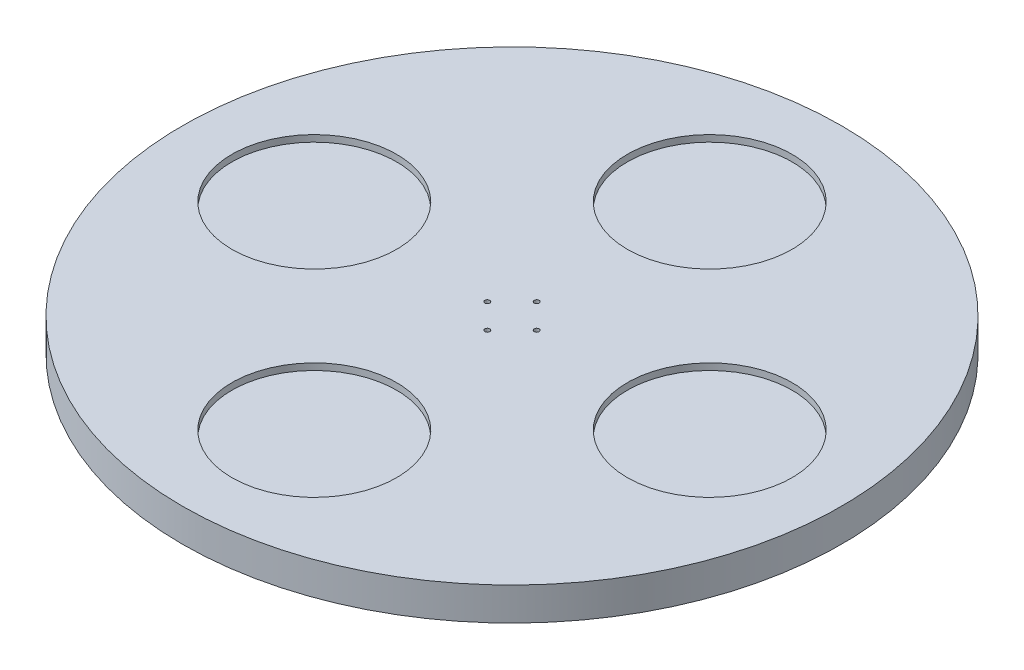
ISO-10303-21;
HEADER;
FILE_DESCRIPTION(('STEP AP214'),'2;1');
FILE_NAME('part.step','',(''),(''),'','','');
FILE_SCHEMA(('AUTOMOTIVE_DESIGN { 1 0 10303 214 1 1 1 1 }'));
ENDSEC;
DATA;
#1=APPLICATION_CONTEXT('core data for automotive mechanical design processes');
#2=APPLICATION_PROTOCOL_DEFINITION('international standard','automotive_design',2000,#1);
#3=PRODUCT_CONTEXT('',#1,'mechanical');
#4=PRODUCT('Part','Part','',(#3));
#5=PRODUCT_RELATED_PRODUCT_CATEGORY('part','',(#4));
#6=PRODUCT_DEFINITION_FORMATION('','',#4);
#7=PRODUCT_DEFINITION_CONTEXT('part definition',#1,'design');
#8=PRODUCT_DEFINITION('design','',#6,#7);
#9=PRODUCT_DEFINITION_SHAPE('','',#8);
#10=(LENGTH_UNIT() NAMED_UNIT(*) SI_UNIT(.MILLI.,.METRE.));
#11=(NAMED_UNIT(*) PLANE_ANGLE_UNIT() SI_UNIT($,.RADIAN.));
#12=(NAMED_UNIT(*) SI_UNIT($,.STERADIAN.) SOLID_ANGLE_UNIT());
#13=UNCERTAINTY_MEASURE_WITH_UNIT(LENGTH_MEASURE(1.E-05),#10,'distance_accuracy_value','');
#14=(GEOMETRIC_REPRESENTATION_CONTEXT(3) GLOBAL_UNCERTAINTY_ASSIGNED_CONTEXT((#13)) GLOBAL_UNIT_ASSIGNED_CONTEXT((#10,
#11,#12)) REPRESENTATION_CONTEXT('',''));
#15=CARTESIAN_POINT('',(0.,0.,0.));
#16=DIRECTION('',(0.,0.,1.));
#17=DIRECTION('',(1.,0.,0.));
#18=AXIS2_PLACEMENT_3D('',#15,#16,#17);
#19=CARTESIAN_POINT('',(0.,10.,0.));
#20=DIRECTION('',(0.,-1.,0.));
#21=DIRECTION('',(0.,0.,-1.));
#22=AXIS2_PLACEMENT_3D('',#19,#20,#21);
#23=CYLINDRICAL_SURFACE('',#22,100.);
#24=CARTESIAN_POINT('',(0.,10.,0.));
#25=DIRECTION('',(0.,1.,0.));
#26=DIRECTION('',(0.,0.,1.));
#27=AXIS2_PLACEMENT_3D('',#24,#25,#26);
#28=CIRCLE('',#27,100.);
#29=CARTESIAN_POINT('',(0.,10.,100.));
#30=VERTEX_POINT('',#29);
#31=EDGE_CURVE('E10',#30,#30,#28,.T.);
#32=ORIENTED_EDGE('',*,*,#31,.F.);
#33=EDGE_LOOP('',(#32));
#34=FACE_BOUND('',#33,.T.);
#35=CARTESIAN_POINT('',(0.,0.,0.));
#36=DIRECTION('',(0.,1.,0.));
#37=DIRECTION('',(0.,0.,1.));
#38=AXIS2_PLACEMENT_3D('',#35,#36,#37);
#39=CIRCLE('',#38,100.);
#40=CARTESIAN_POINT('',(0.,0.,100.));
#41=VERTEX_POINT('',#40);
#42=EDGE_CURVE('E33',#41,#41,#39,.T.);
#43=ORIENTED_EDGE('',*,*,#42,.T.);
#44=EDGE_LOOP('',(#43));
#45=FACE_BOUND('',#44,.T.);
#46=ADVANCED_FACE('F30',(#34,#45),#23,.T.);
#47=CARTESIAN_POINT('',(0.,10.,0.));
#48=DIRECTION('',(0.,1.,0.));
#49=DIRECTION('',(0.,0.,1.));
#50=AXIS2_PLACEMENT_3D('',#47,#48,#49);
#51=PLANE('',#50);
#52=CARTESIAN_POINT('',(-60.,10.,0.));
#53=DIRECTION('',(0.,1.,0.));
#54=DIRECTION('',(0.,0.,1.));
#55=AXIS2_PLACEMENT_3D('',#52,#53,#54);
#56=CIRCLE('',#55,25.);
#57=CARTESIAN_POINT('',(-60.,10.,25.));
#58=VERTEX_POINT('',#57);
#59=EDGE_CURVE('E84',#58,#58,#56,.T.);
#60=ORIENTED_EDGE('',*,*,#59,.F.);
#61=EDGE_LOOP('',(#60));
#62=FACE_BOUND('',#61,.T.);
#63=CARTESIAN_POINT('',(0.,10.,-60.));
#64=DIRECTION('',(0.,1.,0.));
#65=DIRECTION('',(0.,0.,1.));
#66=AXIS2_PLACEMENT_3D('',#63,#64,#65);
#67=CIRCLE('',#66,25.);
#68=CARTESIAN_POINT('',(0.,10.,-35.));
#69=VERTEX_POINT('',#68);
#70=EDGE_CURVE('E78',#69,#69,#67,.T.);
#71=ORIENTED_EDGE('',*,*,#70,.F.);
#72=EDGE_LOOP('',(#71));
#73=FACE_BOUND('',#72,.T.);
#74=CARTESIAN_POINT('',(60.,10.,0.));
#75=DIRECTION('',(0.,1.,0.));
#76=DIRECTION('',(0.,0.,1.));
#77=AXIS2_PLACEMENT_3D('',#74,#75,#76);
#78=CIRCLE('',#77,25.);
#79=CARTESIAN_POINT('',(60.,10.,25.));
#80=VERTEX_POINT('',#79);
#81=EDGE_CURVE('E72',#80,#80,#78,.T.);
#82=ORIENTED_EDGE('',*,*,#81,.F.);
#83=EDGE_LOOP('',(#82));
#84=FACE_BOUND('',#83,.T.);
#85=CARTESIAN_POINT('',(0.,10.,60.));
#86=DIRECTION('',(0.,1.,0.));
#87=DIRECTION('',(0.,0.,1.));
#88=AXIS2_PLACEMENT_3D('',#85,#86,#87);
#89=CIRCLE('',#88,25.);
#90=CARTESIAN_POINT('',(0.,10.,85.));
#91=VERTEX_POINT('',#90);
#92=EDGE_CURVE('E66',#91,#91,#89,.T.);
#93=ORIENTED_EDGE('',*,*,#92,.F.);
#94=EDGE_LOOP('',(#93));
#95=FACE_BOUND('',#94,.T.);
#96=CARTESIAN_POINT('',(-7.5,10.,0.));
#97=DIRECTION('',(0.,1.,0.));
#98=DIRECTION('',(0.,0.,1.));
#99=AXIS2_PLACEMENT_3D('',#96,#97,#98);
#100=CIRCLE('',#99,0.75);
#101=CARTESIAN_POINT('',(-7.5,10.,0.75));
#102=VERTEX_POINT('',#101);
#103=EDGE_CURVE('E61',#102,#102,#100,.T.);
#104=ORIENTED_EDGE('',*,*,#103,.F.);
#105=EDGE_LOOP('',(#104));
#106=FACE_BOUND('',#105,.T.);
#107=CARTESIAN_POINT('',(0.,10.,7.5));
#108=DIRECTION('',(0.,1.,0.));
#109=DIRECTION('',(0.,0.,1.));
#110=AXIS2_PLACEMENT_3D('',#107,#108,#109);
#111=CIRCLE('',#110,0.750000000000001);
#112=CARTESIAN_POINT('',(0.,10.,8.25));
#113=VERTEX_POINT('',#112);
#114=EDGE_CURVE('E58',#113,#113,#111,.T.);
#115=ORIENTED_EDGE('',*,*,#114,.F.);
#116=EDGE_LOOP('',(#115));
#117=FACE_BOUND('',#116,.T.);
#118=CARTESIAN_POINT('',(7.5,10.,0.));
#119=DIRECTION('',(0.,1.,0.));
#120=DIRECTION('',(0.,0.,1.));
#121=AXIS2_PLACEMENT_3D('',#118,#119,#120);
#122=CIRCLE('',#121,0.750000000000001);
#123=CARTESIAN_POINT('',(7.5,10.,0.750000000000053));
#124=VERTEX_POINT('',#123);
#125=EDGE_CURVE('E52',#124,#124,#122,.T.);
#126=ORIENTED_EDGE('',*,*,#125,.F.);
#127=EDGE_LOOP('',(#126));
#128=FACE_BOUND('',#127,.T.);
#129=CARTESIAN_POINT('',(0.,10.,-7.5));
#130=DIRECTION('',(0.,1.,0.));
#131=DIRECTION('',(0.,0.,1.));
#132=AXIS2_PLACEMENT_3D('',#129,#130,#131);
#133=CIRCLE('',#132,0.75);
#134=CARTESIAN_POINT('',(0.,10.,-6.75));
#135=VERTEX_POINT('',#134);
#136=EDGE_CURVE('E45',#135,#135,#133,.T.);
#137=ORIENTED_EDGE('',*,*,#136,.F.);
#138=EDGE_LOOP('',(#137));
#139=FACE_BOUND('',#138,.T.);
#140=ORIENTED_EDGE('',*,*,#31,.T.);
#141=EDGE_LOOP('',(#140));
#142=FACE_BOUND('',#141,.T.);
#143=ADVANCED_FACE('F99',(#62,#73,#84,#95,#106,#117,#128,#139,#142),#51,.T.);
#144=CARTESIAN_POINT('',(0.,0.,0.));
#145=DIRECTION('',(0.,1.,0.));
#146=DIRECTION('',(0.,0.,1.));
#147=AXIS2_PLACEMENT_3D('',#144,#145,#146);
#148=PLANE('',#147);
#149=CARTESIAN_POINT('',(-7.5,0.,0.));
#150=DIRECTION('',(0.,1.,0.));
#151=DIRECTION('',(0.,0.,1.));
#152=AXIS2_PLACEMENT_3D('',#149,#150,#151);
#153=CIRCLE('',#152,0.75);
#154=CARTESIAN_POINT('',(-7.5,0.,0.75));
#155=VERTEX_POINT('',#154);
#156=EDGE_CURVE('E40',#155,#155,#153,.T.);
#157=ORIENTED_EDGE('',*,*,#156,.T.);
#158=EDGE_LOOP('',(#157));
#159=FACE_BOUND('',#158,.T.);
#160=CARTESIAN_POINT('',(0.,0.,7.5));
#161=DIRECTION('',(0.,1.,0.));
#162=DIRECTION('',(0.,0.,1.));
#163=AXIS2_PLACEMENT_3D('',#160,#161,#162);
#164=CIRCLE('',#163,0.750000000000001);
#165=CARTESIAN_POINT('',(0.,0.,8.25));
#166=VERTEX_POINT('',#165);
#167=EDGE_CURVE('E55',#166,#166,#164,.T.);
#168=ORIENTED_EDGE('',*,*,#167,.T.);
#169=EDGE_LOOP('',(#168));
#170=FACE_BOUND('',#169,.T.);
#171=CARTESIAN_POINT('',(7.5,0.,0.));
#172=DIRECTION('',(0.,1.,0.));
#173=DIRECTION('',(0.,0.,1.));
#174=AXIS2_PLACEMENT_3D('',#171,#172,#173);
#175=CIRCLE('',#174,0.750000000000001);
#176=CARTESIAN_POINT('',(7.5,0.,0.750000000000053));
#177=VERTEX_POINT('',#176);
#178=EDGE_CURVE('E49',#177,#177,#175,.T.);
#179=ORIENTED_EDGE('',*,*,#178,.T.);
#180=EDGE_LOOP('',(#179));
#181=FACE_BOUND('',#180,.T.);
#182=CARTESIAN_POINT('',(0.,0.,-7.5));
#183=DIRECTION('',(0.,1.,0.));
#184=DIRECTION('',(0.,0.,1.));
#185=AXIS2_PLACEMENT_3D('',#182,#183,#184);
#186=CIRCLE('',#185,0.75);
#187=CARTESIAN_POINT('',(0.,0.,-6.75));
#188=VERTEX_POINT('',#187);
#189=EDGE_CURVE('E42',#188,#188,#186,.T.);
#190=ORIENTED_EDGE('',*,*,#189,.T.);
#191=EDGE_LOOP('',(#190));
#192=FACE_BOUND('',#191,.T.);
#193=ORIENTED_EDGE('',*,*,#42,.F.);
#194=EDGE_LOOP('',(#193));
#195=FACE_BOUND('',#194,.T.);
#196=ADVANCED_FACE('F102',(#159,#170,#181,#192,#195),#148,.F.);
#197=CARTESIAN_POINT('',(0.,0.,-7.5));
#198=DIRECTION('',(0.,1.,0.));
#199=DIRECTION('',(0.,0.,1.));
#200=AXIS2_PLACEMENT_3D('',#197,#198,#199);
#201=CYLINDRICAL_SURFACE('',#200,0.75);
#202=ORIENTED_EDGE('',*,*,#189,.F.);
#203=EDGE_LOOP('',(#202));
#204=FACE_BOUND('',#203,.T.);
#205=ORIENTED_EDGE('',*,*,#136,.T.);
#206=EDGE_LOOP('',(#205));
#207=FACE_BOUND('',#206,.T.);
#208=ADVANCED_FACE('F118',(#204,#207),#201,.F.);
#209=CARTESIAN_POINT('',(7.5,0.,0.));
#210=DIRECTION('',(0.,1.,0.));
#211=DIRECTION('',(0.,0.,1.));
#212=AXIS2_PLACEMENT_3D('',#209,#210,#211);
#213=CYLINDRICAL_SURFACE('',#212,0.750000000000001);
#214=ORIENTED_EDGE('',*,*,#178,.F.);
#215=EDGE_LOOP('',(#214));
#216=FACE_BOUND('',#215,.T.);
#217=ORIENTED_EDGE('',*,*,#125,.T.);
#218=EDGE_LOOP('',(#217));
#219=FACE_BOUND('',#218,.T.);
#220=ADVANCED_FACE('F120',(#216,#219),#213,.F.);
#221=CARTESIAN_POINT('',(0.,0.,7.5));
#222=DIRECTION('',(0.,1.,0.));
#223=DIRECTION('',(0.,0.,1.));
#224=AXIS2_PLACEMENT_3D('',#221,#222,#223);
#225=CYLINDRICAL_SURFACE('',#224,0.750000000000001);
#226=ORIENTED_EDGE('',*,*,#167,.F.);
#227=EDGE_LOOP('',(#226));
#228=FACE_BOUND('',#227,.T.);
#229=ORIENTED_EDGE('',*,*,#114,.T.);
#230=EDGE_LOOP('',(#229));
#231=FACE_BOUND('',#230,.T.);
#232=ADVANCED_FACE('F127',(#228,#231),#225,.F.);
#233=CARTESIAN_POINT('',(-7.5,0.,0.));
#234=DIRECTION('',(0.,1.,0.));
#235=DIRECTION('',(0.,0.,1.));
#236=AXIS2_PLACEMENT_3D('',#233,#234,#235);
#237=CYLINDRICAL_SURFACE('',#236,0.75);
#238=ORIENTED_EDGE('',*,*,#156,.F.);
#239=EDGE_LOOP('',(#238));
#240=FACE_BOUND('',#239,.T.);
#241=ORIENTED_EDGE('',*,*,#103,.T.);
#242=EDGE_LOOP('',(#241));
#243=FACE_BOUND('',#242,.T.);
#244=ADVANCED_FACE('F167',(#240,#243),#237,.F.);
#245=CARTESIAN_POINT('',(0.,8.,60.));
#246=DIRECTION('',(0.,1.,0.));
#247=DIRECTION('',(0.,0.,1.));
#248=AXIS2_PLACEMENT_3D('',#245,#246,#247);
#249=CYLINDRICAL_SURFACE('',#248,25.);
#250=CARTESIAN_POINT('',(0.,8.,60.));
#251=DIRECTION('',(0.,1.,0.));
#252=DIRECTION('',(0.,0.,1.));
#253=AXIS2_PLACEMENT_3D('',#250,#251,#252);
#254=CIRCLE('',#253,25.);
#255=CARTESIAN_POINT('',(0.,8.,85.));
#256=VERTEX_POINT('',#255);
#257=EDGE_CURVE('E69',#256,#256,#254,.T.);
#258=ORIENTED_EDGE('',*,*,#257,.F.);
#259=EDGE_LOOP('',(#258));
#260=FACE_BOUND('',#259,.T.);
#261=ORIENTED_EDGE('',*,*,#92,.T.);
#262=EDGE_LOOP('',(#261));
#263=FACE_BOUND('',#262,.T.);
#264=ADVANCED_FACE('F176',(#260,#263),#249,.F.);
#265=CARTESIAN_POINT('',(0.,8.,60.));
#266=DIRECTION('',(0.,1.,0.));
#267=DIRECTION('',(0.,0.,1.));
#268=AXIS2_PLACEMENT_3D('',#265,#266,#267);
#269=PLANE('',#268);
#270=ORIENTED_EDGE('',*,*,#257,.T.);
#271=EDGE_LOOP('',(#270));
#272=FACE_BOUND('',#271,.T.);
#273=ADVANCED_FACE('F186',(#272),#269,.T.);
#274=CARTESIAN_POINT('',(60.,8.,0.));
#275=DIRECTION('',(0.,1.,0.));
#276=DIRECTION('',(0.,0.,1.));
#277=AXIS2_PLACEMENT_3D('',#274,#275,#276);
#278=CYLINDRICAL_SURFACE('',#277,25.);
#279=CARTESIAN_POINT('',(60.,8.,0.));
#280=DIRECTION('',(0.,1.,0.));
#281=DIRECTION('',(0.,0.,1.));
#282=AXIS2_PLACEMENT_3D('',#279,#280,#281);
#283=CIRCLE('',#282,25.);
#284=CARTESIAN_POINT('',(60.,8.,25.));
#285=VERTEX_POINT('',#284);
#286=EDGE_CURVE('E75',#285,#285,#283,.T.);
#287=ORIENTED_EDGE('',*,*,#286,.F.);
#288=EDGE_LOOP('',(#287));
#289=FACE_BOUND('',#288,.T.);
#290=ORIENTED_EDGE('',*,*,#81,.T.);
#291=EDGE_LOOP('',(#290));
#292=FACE_BOUND('',#291,.T.);
#293=ADVANCED_FACE('F193',(#289,#292),#278,.F.);
#294=CARTESIAN_POINT('',(60.,8.,0.));
#295=DIRECTION('',(0.,1.,0.));
#296=DIRECTION('',(0.,0.,1.));
#297=AXIS2_PLACEMENT_3D('',#294,#295,#296);
#298=PLANE('',#297);
#299=ORIENTED_EDGE('',*,*,#286,.T.);
#300=EDGE_LOOP('',(#299));
#301=FACE_BOUND('',#300,.T.);
#302=ADVANCED_FACE('F201',(#301),#298,.T.);
#303=CARTESIAN_POINT('',(0.,8.,-60.));
#304=DIRECTION('',(0.,1.,0.));
#305=DIRECTION('',(0.,0.,1.));
#306=AXIS2_PLACEMENT_3D('',#303,#304,#305);
#307=CYLINDRICAL_SURFACE('',#306,25.);
#308=CARTESIAN_POINT('',(0.,8.,-60.));
#309=DIRECTION('',(0.,1.,0.));
#310=DIRECTION('',(0.,0.,1.));
#311=AXIS2_PLACEMENT_3D('',#308,#309,#310);
#312=CIRCLE('',#311,25.);
#313=CARTESIAN_POINT('',(0.,8.,-35.));
#314=VERTEX_POINT('',#313);
#315=EDGE_CURVE('E81',#314,#314,#312,.T.);
#316=ORIENTED_EDGE('',*,*,#315,.F.);
#317=EDGE_LOOP('',(#316));
#318=FACE_BOUND('',#317,.T.);
#319=ORIENTED_EDGE('',*,*,#70,.T.);
#320=EDGE_LOOP('',(#319));
#321=FACE_BOUND('',#320,.T.);
#322=ADVANCED_FACE('F209',(#318,#321),#307,.F.);
#323=CARTESIAN_POINT('',(0.,8.,-60.));
#324=DIRECTION('',(0.,1.,0.));
#325=DIRECTION('',(0.,0.,1.));
#326=AXIS2_PLACEMENT_3D('',#323,#324,#325);
#327=PLANE('',#326);
#328=ORIENTED_EDGE('',*,*,#315,.T.);
#329=EDGE_LOOP('',(#328));
#330=FACE_BOUND('',#329,.T.);
#331=ADVANCED_FACE('F95',(#330),#327,.T.);
#332=CARTESIAN_POINT('',(-60.,8.,0.));
#333=DIRECTION('',(0.,1.,0.));
#334=DIRECTION('',(0.,0.,1.));
#335=AXIS2_PLACEMENT_3D('',#332,#333,#334);
#336=CYLINDRICAL_SURFACE('',#335,25.);
#337=CARTESIAN_POINT('',(-60.,8.,0.));
#338=DIRECTION('',(0.,1.,0.));
#339=DIRECTION('',(0.,0.,1.));
#340=AXIS2_PLACEMENT_3D('',#337,#338,#339);
#341=CIRCLE('',#340,25.);
#342=CARTESIAN_POINT('',(-60.,8.,25.));
#343=VERTEX_POINT('',#342);
#344=EDGE_CURVE('E46',#343,#343,#341,.T.);
#345=ORIENTED_EDGE('',*,*,#344,.F.);
#346=EDGE_LOOP('',(#345));
#347=FACE_BOUND('',#346,.T.);
#348=ORIENTED_EDGE('',*,*,#59,.T.);
#349=EDGE_LOOP('',(#348));
#350=FACE_BOUND('',#349,.T.);
#351=ADVANCED_FACE('F92',(#347,#350),#336,.F.);
#352=CARTESIAN_POINT('',(-60.,8.,0.));
#353=DIRECTION('',(0.,1.,0.));
#354=DIRECTION('',(0.,0.,1.));
#355=AXIS2_PLACEMENT_3D('',#352,#353,#354);
#356=PLANE('',#355);
#357=ORIENTED_EDGE('',*,*,#344,.T.);
#358=EDGE_LOOP('',(#357));
#359=FACE_BOUND('',#358,.T.);
#360=ADVANCED_FACE('F90',(#359),#356,.T.);
#361=CLOSED_SHELL('',(#46,#143,#196,#208,#220,#232,#244,#264,#273,#293,#302,#322,#331,#351,#360));
#362=MANIFOLD_SOLID_BREP('B2',#361);
#363=ADVANCED_BREP_SHAPE_REPRESENTATION('',(#18,#362),#14);
#364=SHAPE_DEFINITION_REPRESENTATION(#9,#363);
ENDSEC;
END-ISO-10303-21;
